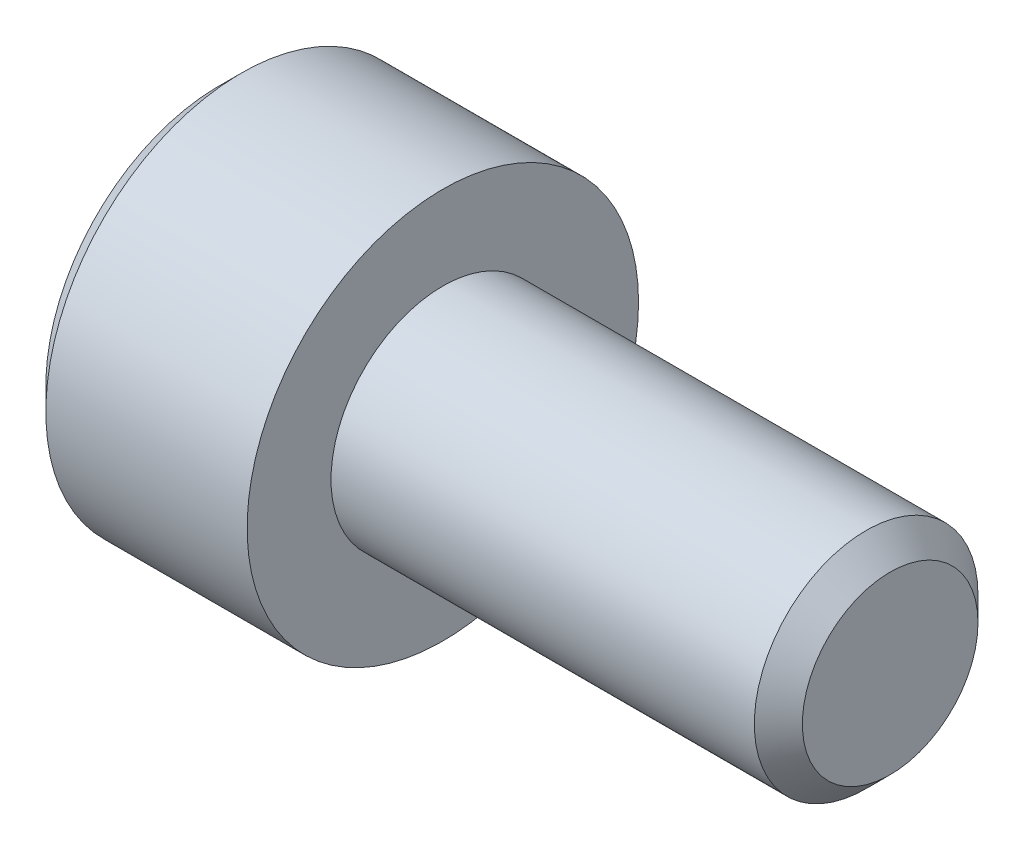
ISO-10303-21;
HEADER;
FILE_DESCRIPTION(('STEP AP214'),'2;1');
FILE_NAME('part.step','',(''),(''),'','','');
FILE_SCHEMA(('AUTOMOTIVE_DESIGN { 1 0 10303 214 1 1 1 1 }'));
ENDSEC;
DATA;
#1=APPLICATION_CONTEXT('core data for automotive mechanical design processes');
#2=APPLICATION_PROTOCOL_DEFINITION('international standard','automotive_design',2000,#1);
#3=PRODUCT_CONTEXT('',#1,'mechanical');
#4=PRODUCT('Part','Part','',(#3));
#5=PRODUCT_RELATED_PRODUCT_CATEGORY('part','',(#4));
#6=PRODUCT_DEFINITION_FORMATION('','',#4);
#7=PRODUCT_DEFINITION_CONTEXT('part definition',#1,'design');
#8=PRODUCT_DEFINITION('design','',#6,#7);
#9=PRODUCT_DEFINITION_SHAPE('','',#8);
#10=(LENGTH_UNIT() NAMED_UNIT(*) SI_UNIT(.MILLI.,.METRE.));
#11=(NAMED_UNIT(*) PLANE_ANGLE_UNIT() SI_UNIT($,.RADIAN.));
#12=(NAMED_UNIT(*) SI_UNIT($,.STERADIAN.) SOLID_ANGLE_UNIT());
#13=UNCERTAINTY_MEASURE_WITH_UNIT(LENGTH_MEASURE(1.E-05),#10,'distance_accuracy_value','');
#14=(GEOMETRIC_REPRESENTATION_CONTEXT(3) GLOBAL_UNCERTAINTY_ASSIGNED_CONTEXT((#13)) GLOBAL_UNIT_ASSIGNED_CONTEXT((#10,
#11,#12)) REPRESENTATION_CONTEXT('',''));
#15=CARTESIAN_POINT('',(0.,0.,0.));
#16=DIRECTION('',(0.,0.,1.));
#17=DIRECTION('',(1.,0.,0.));
#18=AXIS2_PLACEMENT_3D('',#15,#16,#17);
#19=CARTESIAN_POINT('',(-4.,0.,0.));
#20=DIRECTION('',(1.,0.,0.));
#21=DIRECTION('',(0.,1.,0.));
#22=AXIS2_PLACEMENT_3D('',#19,#20,#21);
#23=PLANE('',#22);
#24=CARTESIAN_POINT('',(-4.,0.,0.));
#25=DIRECTION('',(1.,0.,0.));
#26=DIRECTION('',(0.,0.,-1.));
#27=AXIS2_PLACEMENT_3D('',#24,#25,#26);
#28=CIRCLE('',#27,3.1);
#29=CARTESIAN_POINT('',(-4.,0.,-3.1));
#30=VERTEX_POINT('',#29);
#31=EDGE_CURVE('E37',#30,#30,#28,.T.);
#32=ORIENTED_EDGE('',*,*,#31,.F.);
#33=EDGE_LOOP('',(#32));
#34=FACE_BOUND('',#33,.T.);
#35=DIRECTION('',(0.,0.5,-0.866025403784439));
#36=VECTOR('',#35,1.);
#37=CARTESIAN_POINT('',(-4.,-1.73205080756888,0.));
#38=LINE('',#37,#36);
#39=CARTESIAN_POINT('',(-4.,-1.73205080756888,0.));
#40=VERTEX_POINT('',#39);
#41=CARTESIAN_POINT('',(-4.,-0.866025403784439,-1.5));
#42=VERTEX_POINT('',#41);
#43=EDGE_CURVE('E11',#40,#42,#38,.T.);
#44=ORIENTED_EDGE('',*,*,#43,.T.);
#45=DIRECTION('',(0.,1.,0.));
#46=VECTOR('',#45,1.);
#47=CARTESIAN_POINT('',(-4.,-0.866025403784439,-1.5));
#48=LINE('',#47,#46);
#49=CARTESIAN_POINT('',(-4.,0.866025403784438,-1.5));
#50=VERTEX_POINT('',#49);
#51=EDGE_CURVE('E20',#42,#50,#48,.T.);
#52=ORIENTED_EDGE('',*,*,#51,.T.);
#53=DIRECTION('',(0.,0.5,0.866025403784439));
#54=VECTOR('',#53,1.);
#55=CARTESIAN_POINT('',(-4.,0.866025403784439,-1.5));
#56=LINE('',#55,#54);
#57=CARTESIAN_POINT('',(-4.,1.73205080756888,0.));
#58=VERTEX_POINT('',#57);
#59=EDGE_CURVE('E154',#50,#58,#56,.T.);
#60=ORIENTED_EDGE('',*,*,#59,.T.);
#61=DIRECTION('',(0.,-0.5,0.866025403784439));
#62=VECTOR('',#61,1.);
#63=CARTESIAN_POINT('',(-4.,1.73205080756888,0.));
#64=LINE('',#63,#62);
#65=CARTESIAN_POINT('',(-4.,0.866025403784439,1.5));
#66=VERTEX_POINT('',#65);
#67=EDGE_CURVE('E158',#58,#66,#64,.T.);
#68=ORIENTED_EDGE('',*,*,#67,.T.);
#69=DIRECTION('',(0.,-1.,0.));
#70=VECTOR('',#69,1.);
#71=CARTESIAN_POINT('',(-4.,0.866025403784439,1.5));
#72=LINE('',#71,#70);
#73=CARTESIAN_POINT('',(-4.,-0.866025403784439,1.5));
#74=VERTEX_POINT('',#73);
#75=EDGE_CURVE('E153',#66,#74,#72,.T.);
#76=ORIENTED_EDGE('',*,*,#75,.T.);
#77=DIRECTION('',(0.,-0.5,-0.866025403784439));
#78=VECTOR('',#77,1.);
#79=CARTESIAN_POINT('',(-4.,-0.866025403784439,1.5));
#80=LINE('',#79,#78);
#81=EDGE_CURVE('E150',#74,#40,#80,.T.);
#82=ORIENTED_EDGE('',*,*,#81,.T.);
#83=EDGE_LOOP('',(#44,#52,#60,#68,#76,#82));
#84=FACE_BOUND('',#83,.T.);
#85=ADVANCED_FACE('F16',(#34,#84),#23,.F.);
#86=CARTESIAN_POINT('',(-4.,0.,0.));
#87=DIRECTION('',(1.,0.,0.));
#88=DIRECTION('',(0.,0.,-1.));
#89=AXIS2_PLACEMENT_3D('',#86,#87,#88);
#90=CONICAL_SURFACE('',#89,3.1,0.785398163397449);
#91=CARTESIAN_POINT('',(-3.6,0.,0.));
#92=DIRECTION('',(1.,0.,0.));
#93=DIRECTION('',(0.,0.,-1.));
#94=AXIS2_PLACEMENT_3D('',#91,#92,#93);
#95=CIRCLE('',#94,3.5);
#96=CARTESIAN_POINT('',(-3.6,0.,-3.5));
#97=VERTEX_POINT('',#96);
#98=EDGE_CURVE('E187',#97,#97,#95,.T.);
#99=ORIENTED_EDGE('',*,*,#98,.F.);
#100=EDGE_LOOP('',(#99));
#101=FACE_BOUND('',#100,.T.);
#102=ORIENTED_EDGE('',*,*,#31,.T.);
#103=EDGE_LOOP('',(#102));
#104=FACE_BOUND('',#103,.T.);
#105=ADVANCED_FACE('F319',(#101,#104),#90,.T.);
#106=CARTESIAN_POINT('',(8.,0.,0.));
#107=DIRECTION('',(1.,0.,0.));
#108=DIRECTION('',(0.,0.,-1.));
#109=AXIS2_PLACEMENT_3D('',#106,#107,#108);
#110=CYLINDRICAL_SURFACE('',#109,3.5);
#111=CARTESIAN_POINT('',(0.,0.,0.));
#112=DIRECTION('',(1.,0.,0.));
#113=DIRECTION('',(0.,0.,-1.));
#114=AXIS2_PLACEMENT_3D('',#111,#112,#113);
#115=CIRCLE('',#114,3.5);
#116=CARTESIAN_POINT('',(0.,0.,-3.5));
#117=VERTEX_POINT('',#116);
#118=EDGE_CURVE('E144',#117,#117,#115,.T.);
#119=ORIENTED_EDGE('',*,*,#118,.F.);
#120=EDGE_LOOP('',(#119));
#121=FACE_BOUND('',#120,.T.);
#122=ORIENTED_EDGE('',*,*,#98,.T.);
#123=EDGE_LOOP('',(#122));
#124=FACE_BOUND('',#123,.T.);
#125=ADVANCED_FACE('F324',(#121,#124),#110,.T.);
#126=CARTESIAN_POINT('',(0.,3.5,0.));
#127=DIRECTION('',(-1.,0.,0.));
#128=DIRECTION('',(0.,0.,1.));
#129=AXIS2_PLACEMENT_3D('',#126,#127,#128);
#130=PLANE('',#129);
#131=CARTESIAN_POINT('',(0.,0.,0.));
#132=DIRECTION('',(1.,0.,0.));
#133=DIRECTION('',(0.,0.,-1.));
#134=AXIS2_PLACEMENT_3D('',#131,#132,#133);
#135=CIRCLE('',#134,2.);
#136=CARTESIAN_POINT('',(0.,0.,-2.));
#137=VERTEX_POINT('',#136);
#138=EDGE_CURVE('E136',#137,#137,#135,.T.);
#139=ORIENTED_EDGE('',*,*,#138,.F.);
#140=EDGE_LOOP('',(#139));
#141=FACE_BOUND('',#140,.T.);
#142=ORIENTED_EDGE('',*,*,#118,.T.);
#143=EDGE_LOOP('',(#142));
#144=FACE_BOUND('',#143,.T.);
#145=ADVANCED_FACE('F345',(#141,#144),#130,.F.);
#146=CARTESIAN_POINT('',(8.,0.,0.));
#147=DIRECTION('',(1.,0.,0.));
#148=DIRECTION('',(0.,0.,-1.));
#149=AXIS2_PLACEMENT_3D('',#146,#147,#148);
#150=CYLINDRICAL_SURFACE('',#149,2.);
#151=CARTESIAN_POINT('',(7.5705,0.,0.));
#152=DIRECTION('',(1.,0.,0.));
#153=DIRECTION('',(0.,0.,-1.));
#154=AXIS2_PLACEMENT_3D('',#151,#152,#153);
#155=CIRCLE('',#154,2.);
#156=CARTESIAN_POINT('',(7.5705,0.,-2.));
#157=VERTEX_POINT('',#156);
#158=EDGE_CURVE('E131',#157,#157,#155,.T.);
#159=ORIENTED_EDGE('',*,*,#158,.F.);
#160=EDGE_LOOP('',(#159));
#161=FACE_BOUND('',#160,.T.);
#162=ORIENTED_EDGE('',*,*,#138,.T.);
#163=EDGE_LOOP('',(#162));
#164=FACE_BOUND('',#163,.T.);
#165=ADVANCED_FACE('F132',(#161,#164),#150,.T.);
#166=CARTESIAN_POINT('',(7.5705,0.,0.));
#167=DIRECTION('',(-1.,0.,0.));
#168=DIRECTION('',(0.,0.,1.));
#169=AXIS2_PLACEMENT_3D('',#166,#167,#168);
#170=CONICAL_SURFACE('',#169,2.,0.785398163397448);
#171=CARTESIAN_POINT('',(8.,0.,0.));
#172=DIRECTION('',(1.,0.,0.));
#173=DIRECTION('',(0.,0.,-1.));
#174=AXIS2_PLACEMENT_3D('',#171,#172,#173);
#175=CIRCLE('',#174,1.5705);
#176=CARTESIAN_POINT('',(8.,0.,-1.5705));
#177=VERTEX_POINT('',#176);
#178=EDGE_CURVE('E137',#177,#177,#175,.T.);
#179=ORIENTED_EDGE('',*,*,#178,.F.);
#180=EDGE_LOOP('',(#179));
#181=FACE_BOUND('',#180,.T.);
#182=ORIENTED_EDGE('',*,*,#158,.T.);
#183=EDGE_LOOP('',(#182));
#184=FACE_BOUND('',#183,.T.);
#185=ADVANCED_FACE('F334',(#181,#184),#170,.T.);
#186=CARTESIAN_POINT('',(8.,1.5705,0.));
#187=DIRECTION('',(-1.,0.,0.));
#188=DIRECTION('',(0.,0.,1.));
#189=AXIS2_PLACEMENT_3D('',#186,#187,#188);
#190=PLANE('',#189);
#191=ORIENTED_EDGE('',*,*,#178,.T.);
#192=EDGE_LOOP('',(#191));
#193=FACE_BOUND('',#192,.T.);
#194=ADVANCED_FACE('F337',(#193),#190,.F.);
#195=CARTESIAN_POINT('',(-2.,0.866025403784439,1.5));
#196=DIRECTION('',(0.,0.,-1.));
#197=DIRECTION('',(0.,-1.,0.));
#198=AXIS2_PLACEMENT_3D('',#195,#196,#197);
#199=PLANE('',#198);
#200=ORIENTED_EDGE('',*,*,#75,.F.);
#201=DIRECTION('',(-1.,0.,0.));
#202=VECTOR('',#201,1.);
#203=CARTESIAN_POINT('',(-2.,0.866025403784439,1.5));
#204=LINE('',#203,#202);
#205=CARTESIAN_POINT('',(-2.,0.866025403784439,1.5));
#206=VERTEX_POINT('',#205);
#207=EDGE_CURVE('E169',#206,#66,#204,.T.);
#208=ORIENTED_EDGE('',*,*,#207,.F.);
#209=DIRECTION('',(0.,-1.,0.));
#210=VECTOR('',#209,1.);
#211=CARTESIAN_POINT('',(-2.,0.866025403784439,1.5));
#212=LINE('',#211,#210);
#213=CARTESIAN_POINT('',(-2.,0.,1.5));
#214=VERTEX_POINT('',#213);
#215=EDGE_CURVE('E147',#206,#214,#212,.T.);
#216=ORIENTED_EDGE('',*,*,#215,.T.);
#217=DIRECTION('',(0.,-1.,0.));
#218=VECTOR('',#217,1.);
#219=CARTESIAN_POINT('',(-2.,0.866025403784439,1.5));
#220=LINE('',#219,#218);
#221=CARTESIAN_POINT('',(-2.,-0.866025403784439,1.5));
#222=VERTEX_POINT('',#221);
#223=EDGE_CURVE('E174',#214,#222,#220,.T.);
#224=ORIENTED_EDGE('',*,*,#223,.T.);
#225=DIRECTION('',(-1.,0.,0.));
#226=VECTOR('',#225,1.);
#227=CARTESIAN_POINT('',(-2.,-0.866025403784439,1.5));
#228=LINE('',#227,#226);
#229=EDGE_CURVE('E178',#222,#74,#228,.T.);
#230=ORIENTED_EDGE('',*,*,#229,.T.);
#231=EDGE_LOOP('',(#200,#208,#216,#224,#230));
#232=FACE_BOUND('',#231,.T.);
#233=ADVANCED_FACE('F304',(#232),#199,.T.);
#234=CARTESIAN_POINT('',(-2.,-0.866025403784439,1.5));
#235=DIRECTION('',(0.,0.866025403784439,-0.5));
#236=DIRECTION('',(-1.,0.,0.));
#237=AXIS2_PLACEMENT_3D('',#234,#235,#236);
#238=PLANE('',#237);
#239=ORIENTED_EDGE('',*,*,#81,.F.);
#240=ORIENTED_EDGE('',*,*,#229,.F.);
#241=DIRECTION('',(0.,-0.5,-0.866025403784439));
#242=VECTOR('',#241,1.);
#243=CARTESIAN_POINT('',(-2.,-0.866025403784439,1.5));
#244=LINE('',#243,#242);
#245=CARTESIAN_POINT('',(-2.,-1.29903810567666,0.75));
#246=VERTEX_POINT('',#245);
#247=EDGE_CURVE('E210',#222,#246,#244,.T.);
#248=ORIENTED_EDGE('',*,*,#247,.T.);
#249=DIRECTION('',(0.,-0.5,-0.866025403784439));
#250=VECTOR('',#249,1.);
#251=CARTESIAN_POINT('',(-2.,-0.866025403784439,1.5));
#252=LINE('',#251,#250);
#253=CARTESIAN_POINT('',(-2.,-1.73205080756888,0.));
#254=VERTEX_POINT('',#253);
#255=EDGE_CURVE('E214',#246,#254,#252,.T.);
#256=ORIENTED_EDGE('',*,*,#255,.T.);
#257=DIRECTION('',(-1.,0.,0.));
#258=VECTOR('',#257,1.);
#259=CARTESIAN_POINT('',(-2.,-1.73205080756888,0.));
#260=LINE('',#259,#258);
#261=EDGE_CURVE('E243',#254,#40,#260,.T.);
#262=ORIENTED_EDGE('',*,*,#261,.T.);
#263=EDGE_LOOP('',(#239,#240,#248,#256,#262));
#264=FACE_BOUND('',#263,.T.);
#265=ADVANCED_FACE('F282',(#264),#238,.T.);
#266=CARTESIAN_POINT('',(-2.,-1.73205080756888,0.));
#267=DIRECTION('',(0.,0.866025403784439,0.5));
#268=DIRECTION('',(1.,0.,0.));
#269=AXIS2_PLACEMENT_3D('',#266,#267,#268);
#270=PLANE('',#269);
#271=ORIENTED_EDGE('',*,*,#43,.F.);
#272=ORIENTED_EDGE('',*,*,#261,.F.);
#273=DIRECTION('',(0.,0.5,-0.866025403784439));
#274=VECTOR('',#273,1.);
#275=CARTESIAN_POINT('',(-2.,-1.73205080756888,0.));
#276=LINE('',#275,#274);
#277=CARTESIAN_POINT('',(-2.,-1.29903810567666,-0.75));
#278=VERTEX_POINT('',#277);
#279=EDGE_CURVE('E255',#254,#278,#276,.T.);
#280=ORIENTED_EDGE('',*,*,#279,.T.);
#281=DIRECTION('',(0.,0.5,-0.866025403784439));
#282=VECTOR('',#281,1.);
#283=CARTESIAN_POINT('',(-2.,-1.73205080756888,0.));
#284=LINE('',#283,#282);
#285=CARTESIAN_POINT('',(-2.,-0.866025403784439,-1.5));
#286=VERTEX_POINT('',#285);
#287=EDGE_CURVE('E207',#278,#286,#284,.T.);
#288=ORIENTED_EDGE('',*,*,#287,.T.);
#289=DIRECTION('',(-1.,0.,0.));
#290=VECTOR('',#289,1.);
#291=CARTESIAN_POINT('',(-2.,-0.866025403784439,-1.5));
#292=LINE('',#291,#290);
#293=EDGE_CURVE('E204',#286,#42,#292,.T.);
#294=ORIENTED_EDGE('',*,*,#293,.T.);
#295=EDGE_LOOP('',(#271,#272,#280,#288,#294));
#296=FACE_BOUND('',#295,.T.);
#297=ADVANCED_FACE('F269',(#296),#270,.T.);
#298=CARTESIAN_POINT('',(-2.,-0.866025403784439,-1.5));
#299=DIRECTION('',(0.,0.,1.));
#300=DIRECTION('',(1.,0.,0.));
#301=AXIS2_PLACEMENT_3D('',#298,#299,#300);
#302=PLANE('',#301);
#303=ORIENTED_EDGE('',*,*,#51,.F.);
#304=ORIENTED_EDGE('',*,*,#293,.F.);
#305=DIRECTION('',(0.,1.,0.));
#306=VECTOR('',#305,1.);
#307=CARTESIAN_POINT('',(-2.,-0.866025403784439,-1.5));
#308=LINE('',#307,#306);
#309=CARTESIAN_POINT('',(-2.,0.,-1.5));
#310=VERTEX_POINT('',#309);
#311=EDGE_CURVE('E208',#286,#310,#308,.T.);
#312=ORIENTED_EDGE('',*,*,#311,.T.);
#313=DIRECTION('',(0.,1.,0.));
#314=VECTOR('',#313,1.);
#315=CARTESIAN_POINT('',(-2.,-0.866025403784439,-1.5));
#316=LINE('',#315,#314);
#317=CARTESIAN_POINT('',(-2.,0.866025403784438,-1.5));
#318=VERTEX_POINT('',#317);
#319=EDGE_CURVE('E198',#310,#318,#316,.T.);
#320=ORIENTED_EDGE('',*,*,#319,.T.);
#321=DIRECTION('',(-1.,0.,0.));
#322=VECTOR('',#321,1.);
#323=CARTESIAN_POINT('',(-2.,0.866025403784438,-1.5));
#324=LINE('',#323,#322);
#325=EDGE_CURVE('E194',#318,#50,#324,.T.);
#326=ORIENTED_EDGE('',*,*,#325,.T.);
#327=EDGE_LOOP('',(#303,#304,#312,#320,#326));
#328=FACE_BOUND('',#327,.T.);
#329=ADVANCED_FACE('F275',(#328),#302,.T.);
#330=CARTESIAN_POINT('',(-2.,0.866025403784439,-1.5));
#331=DIRECTION('',(0.,-0.866025403784439,0.5));
#332=DIRECTION('',(-1.,0.,0.));
#333=AXIS2_PLACEMENT_3D('',#330,#331,#332);
#334=PLANE('',#333);
#335=ORIENTED_EDGE('',*,*,#59,.F.);
#336=ORIENTED_EDGE('',*,*,#325,.F.);
#337=DIRECTION('',(0.,0.5,0.866025403784439));
#338=VECTOR('',#337,1.);
#339=CARTESIAN_POINT('',(-2.,0.866025403784439,-1.5));
#340=LINE('',#339,#338);
#341=CARTESIAN_POINT('',(-2.,1.29903810567666,-0.75));
#342=VERTEX_POINT('',#341);
#343=EDGE_CURVE('E199',#318,#342,#340,.T.);
#344=ORIENTED_EDGE('',*,*,#343,.T.);
#345=DIRECTION('',(0.,0.5,0.866025403784439));
#346=VECTOR('',#345,1.);
#347=CARTESIAN_POINT('',(-2.,0.866025403784439,-1.5));
#348=LINE('',#347,#346);
#349=CARTESIAN_POINT('',(-2.,1.73205080756888,0.));
#350=VERTEX_POINT('',#349);
#351=EDGE_CURVE('E203',#342,#350,#348,.T.);
#352=ORIENTED_EDGE('',*,*,#351,.T.);
#353=DIRECTION('',(-1.,0.,0.));
#354=VECTOR('',#353,1.);
#355=CARTESIAN_POINT('',(-2.,1.73205080756888,0.));
#356=LINE('',#355,#354);
#357=EDGE_CURVE('E224',#350,#58,#356,.T.);
#358=ORIENTED_EDGE('',*,*,#357,.T.);
#359=EDGE_LOOP('',(#335,#336,#344,#352,#358));
#360=FACE_BOUND('',#359,.T.);
#361=ADVANCED_FACE('F297',(#360),#334,.T.);
#362=CARTESIAN_POINT('',(-2.,1.73205080756888,0.));
#363=DIRECTION('',(0.,-0.866025403784439,-0.5));
#364=DIRECTION('',(0.,0.5,-0.866025403784439));
#365=AXIS2_PLACEMENT_3D('',#362,#363,#364);
#366=PLANE('',#365);
#367=ORIENTED_EDGE('',*,*,#67,.F.);
#368=ORIENTED_EDGE('',*,*,#357,.F.);
#369=DIRECTION('',(0.,-0.5,0.866025403784439));
#370=VECTOR('',#369,1.);
#371=CARTESIAN_POINT('',(-2.,1.73205080756888,0.));
#372=LINE('',#371,#370);
#373=CARTESIAN_POINT('',(-2.,1.29903810567666,0.75));
#374=VERTEX_POINT('',#373);
#375=EDGE_CURVE('E168',#350,#374,#372,.T.);
#376=ORIENTED_EDGE('',*,*,#375,.T.);
#377=DIRECTION('',(0.,-0.5,0.866025403784439));
#378=VECTOR('',#377,1.);
#379=CARTESIAN_POINT('',(-2.,1.73205080756888,0.));
#380=LINE('',#379,#378);
#381=EDGE_CURVE('E164',#374,#206,#380,.T.);
#382=ORIENTED_EDGE('',*,*,#381,.T.);
#383=ORIENTED_EDGE('',*,*,#207,.T.);
#384=EDGE_LOOP('',(#367,#368,#376,#382,#383));
#385=FACE_BOUND('',#384,.T.);
#386=ADVANCED_FACE('F300',(#385),#366,.T.);
#387=CARTESIAN_POINT('',(-2.,0.,0.));
#388=DIRECTION('',(1.,0.,0.));
#389=DIRECTION('',(0.,1.,0.));
#390=AXIS2_PLACEMENT_3D('',#387,#388,#389);
#391=PLANE('',#390);
#392=CARTESIAN_POINT('',(-2.,0.,0.));
#393=DIRECTION('',(1.,0.,0.));
#394=DIRECTION('',(0.,0.,-1.));
#395=AXIS2_PLACEMENT_3D('',#392,#393,#394);
#396=CIRCLE('',#395,1.5);
#397=EDGE_CURVE('E173',#310,#342,#396,.T.);
#398=ORIENTED_EDGE('',*,*,#397,.T.);
#399=ORIENTED_EDGE('',*,*,#343,.F.);
#400=ORIENTED_EDGE('',*,*,#319,.F.);
#401=EDGE_LOOP('',(#398,#399,#400));
#402=FACE_BOUND('',#401,.T.);
#403=ADVANCED_FACE('F295',(#402),#391,.F.);
#404=CARTESIAN_POINT('',(-2.,0.,0.));
#405=DIRECTION('',(1.,0.,0.));
#406=DIRECTION('',(0.,1.,0.));
#407=AXIS2_PLACEMENT_3D('',#404,#405,#406);
#408=PLANE('',#407);
#409=ORIENTED_EDGE('',*,*,#351,.F.);
#410=CARTESIAN_POINT('',(-2.,0.,0.));
#411=DIRECTION('',(1.,0.,0.));
#412=DIRECTION('',(0.,0.,-1.));
#413=AXIS2_PLACEMENT_3D('',#410,#411,#412);
#414=CIRCLE('',#413,1.5);
#415=EDGE_CURVE('E181',#342,#374,#414,.T.);
#416=ORIENTED_EDGE('',*,*,#415,.T.);
#417=ORIENTED_EDGE('',*,*,#375,.F.);
#418=EDGE_LOOP('',(#409,#416,#417));
#419=FACE_BOUND('',#418,.T.);
#420=ADVANCED_FACE('F316',(#419),#408,.F.);
#421=CARTESIAN_POINT('',(-2.,0.,0.));
#422=DIRECTION('',(1.,0.,0.));
#423=DIRECTION('',(0.,1.,0.));
#424=AXIS2_PLACEMENT_3D('',#421,#422,#423);
#425=PLANE('',#424);
#426=CARTESIAN_POINT('',(-2.,0.,0.));
#427=DIRECTION('',(1.,0.,0.));
#428=DIRECTION('',(0.,0.,-1.));
#429=AXIS2_PLACEMENT_3D('',#426,#427,#428);
#430=CIRCLE('',#429,1.5);
#431=EDGE_CURVE('E162',#374,#214,#430,.T.);
#432=ORIENTED_EDGE('',*,*,#431,.T.);
#433=ORIENTED_EDGE('',*,*,#215,.F.);
#434=ORIENTED_EDGE('',*,*,#381,.F.);
#435=EDGE_LOOP('',(#432,#433,#434));
#436=FACE_BOUND('',#435,.T.);
#437=ADVANCED_FACE('F306',(#436),#425,.F.);
#438=CARTESIAN_POINT('',(-2.,0.,0.));
#439=DIRECTION('',(1.,0.,0.));
#440=DIRECTION('',(0.,1.,0.));
#441=AXIS2_PLACEMENT_3D('',#438,#439,#440);
#442=PLANE('',#441);
#443=CARTESIAN_POINT('',(-2.,0.,0.));
#444=DIRECTION('',(1.,0.,0.));
#445=DIRECTION('',(0.,0.,-1.));
#446=AXIS2_PLACEMENT_3D('',#443,#444,#445);
#447=CIRCLE('',#446,1.5);
#448=EDGE_CURVE('E159',#214,#246,#447,.T.);
#449=ORIENTED_EDGE('',*,*,#448,.T.);
#450=ORIENTED_EDGE('',*,*,#247,.F.);
#451=ORIENTED_EDGE('',*,*,#223,.F.);
#452=EDGE_LOOP('',(#449,#450,#451));
#453=FACE_BOUND('',#452,.T.);
#454=ADVANCED_FACE('F18',(#453),#442,.F.);
#455=CARTESIAN_POINT('',(-2.,0.,0.));
#456=DIRECTION('',(1.,0.,0.));
#457=DIRECTION('',(0.,1.,0.));
#458=AXIS2_PLACEMENT_3D('',#455,#456,#457);
#459=PLANE('',#458);
#460=CARTESIAN_POINT('',(-2.,0.,0.));
#461=DIRECTION('',(1.,0.,0.));
#462=DIRECTION('',(0.,0.,-1.));
#463=AXIS2_PLACEMENT_3D('',#460,#461,#462);
#464=CIRCLE('',#463,1.5);
#465=EDGE_CURVE('E163',#246,#278,#464,.T.);
#466=ORIENTED_EDGE('',*,*,#465,.T.);
#467=ORIENTED_EDGE('',*,*,#279,.F.);
#468=ORIENTED_EDGE('',*,*,#255,.F.);
#469=EDGE_LOOP('',(#466,#467,#468));
#470=FACE_BOUND('',#469,.T.);
#471=ADVANCED_FACE('F287',(#470),#459,.F.);
#472=CARTESIAN_POINT('',(-2.,0.,0.));
#473=DIRECTION('',(1.,0.,0.));
#474=DIRECTION('',(0.,1.,0.));
#475=AXIS2_PLACEMENT_3D('',#472,#473,#474);
#476=PLANE('',#475);
#477=CARTESIAN_POINT('',(-2.,0.,0.));
#478=DIRECTION('',(1.,0.,0.));
#479=DIRECTION('',(0.,0.,-1.));
#480=AXIS2_PLACEMENT_3D('',#477,#478,#479);
#481=CIRCLE('',#480,1.5);
#482=EDGE_CURVE('E225',#278,#310,#481,.T.);
#483=ORIENTED_EDGE('',*,*,#482,.T.);
#484=ORIENTED_EDGE('',*,*,#311,.F.);
#485=ORIENTED_EDGE('',*,*,#287,.F.);
#486=EDGE_LOOP('',(#483,#484,#485));
#487=FACE_BOUND('',#486,.T.);
#488=ADVANCED_FACE('F273',(#487),#476,.F.);
#489=CARTESIAN_POINT('',(-2.,0.,0.));
#490=DIRECTION('',(-1.,0.,0.));
#491=DIRECTION('',(0.,0.,1.));
#492=AXIS2_PLACEMENT_3D('',#489,#490,#491);
#493=CONICAL_SURFACE('',#492,1.5,1.30899693899575);
#494=CARTESIAN_POINT('',(-1.59807621135332,0.,0.));
#495=VERTEX_POINT('',#494);
#496=VERTEX_LOOP('',#495);
#497=FACE_BOUND('',#496,.T.);
#498=ORIENTED_EDGE('',*,*,#415,.F.);
#499=ORIENTED_EDGE('',*,*,#397,.F.);
#500=ORIENTED_EDGE('',*,*,#482,.F.);
#501=ORIENTED_EDGE('',*,*,#465,.F.);
#502=ORIENTED_EDGE('',*,*,#448,.F.);
#503=ORIENTED_EDGE('',*,*,#431,.F.);
#504=EDGE_LOOP('',(#498,#499,#500,#501,#502,#503));
#505=FACE_BOUND('',#504,.T.);
#506=ADVANCED_FACE('F291',(#497,#505),#493,.F.);
#507=CLOSED_SHELL('',(#85,#105,#125,#145,#165,#185,#194,#233,#265,#297,#329,#361,#386,#403,#420,
#437,#454,#471,#488,#506));
#508=MANIFOLD_SOLID_BREP('B1',#507);
#509=ADVANCED_BREP_SHAPE_REPRESENTATION('',(#18,#508),#14);
#510=SHAPE_DEFINITION_REPRESENTATION(#9,#509);
ENDSEC;
END-ISO-10303-21;
